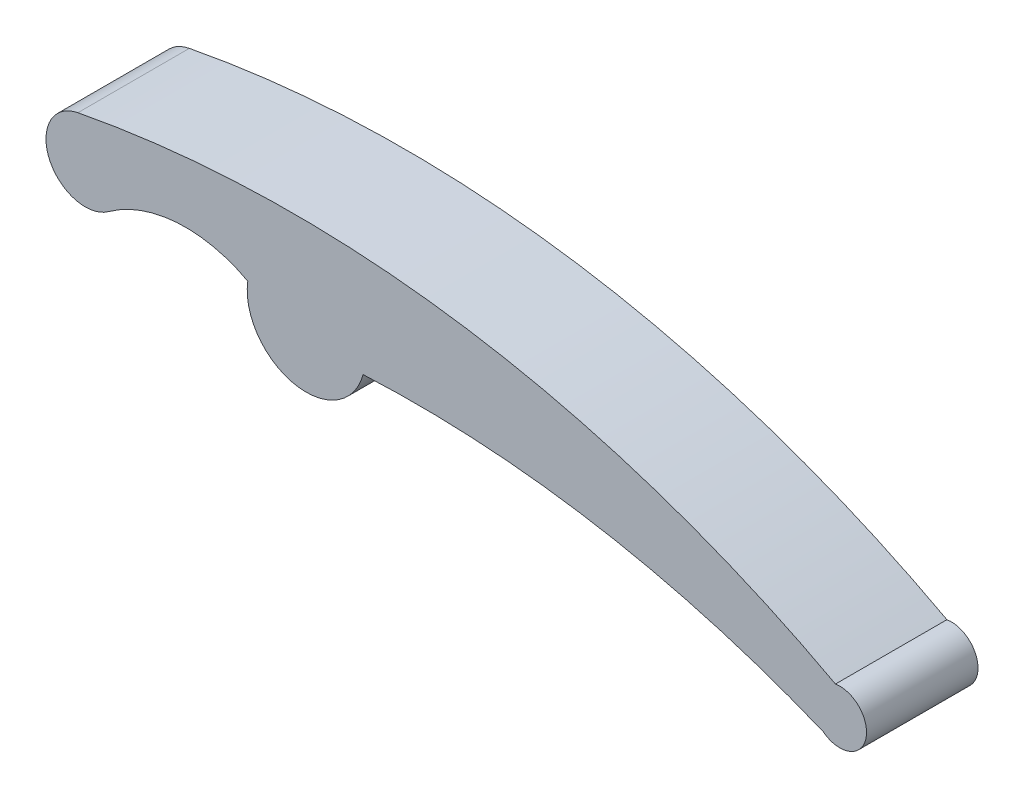
ISO-10303-21;
HEADER;
FILE_DESCRIPTION(('STEP AP214'),'2;1');
FILE_NAME('part.step','',(''),(''),'','','');
FILE_SCHEMA(('AUTOMOTIVE_DESIGN { 1 0 10303 214 1 1 1 1 }'));
ENDSEC;
DATA;
#1=APPLICATION_CONTEXT('core data for automotive mechanical design processes');
#2=APPLICATION_PROTOCOL_DEFINITION('international standard','automotive_design',2000,#1);
#3=PRODUCT_CONTEXT('',#1,'mechanical');
#4=PRODUCT('Part','Part','',(#3));
#5=PRODUCT_RELATED_PRODUCT_CATEGORY('part','',(#4));
#6=PRODUCT_DEFINITION_FORMATION('','',#4);
#7=PRODUCT_DEFINITION_CONTEXT('part definition',#1,'design');
#8=PRODUCT_DEFINITION('design','',#6,#7);
#9=PRODUCT_DEFINITION_SHAPE('','',#8);
#10=(LENGTH_UNIT() NAMED_UNIT(*) SI_UNIT(.MILLI.,.METRE.));
#11=(NAMED_UNIT(*) PLANE_ANGLE_UNIT() SI_UNIT($,.RADIAN.));
#12=(NAMED_UNIT(*) SI_UNIT($,.STERADIAN.) SOLID_ANGLE_UNIT());
#13=UNCERTAINTY_MEASURE_WITH_UNIT(LENGTH_MEASURE(1.E-05),#10,'distance_accuracy_value','');
#14=(GEOMETRIC_REPRESENTATION_CONTEXT(3) GLOBAL_UNCERTAINTY_ASSIGNED_CONTEXT((#13)) GLOBAL_UNIT_ASSIGNED_CONTEXT((#10,
#11,#12)) REPRESENTATION_CONTEXT('',''));
#15=CARTESIAN_POINT('',(0.,0.,0.));
#16=DIRECTION('',(0.,0.,1.));
#17=DIRECTION('',(1.,0.,0.));
#18=AXIS2_PLACEMENT_3D('',#15,#16,#17);
#19=CARTESIAN_POINT('',(-32.4372603048899,-28.9758539782991,30.));
#20=DIRECTION('',(0.,0.,-1.));
#21=DIRECTION('',(-1.,0.,0.));
#22=AXIS2_PLACEMENT_3D('',#19,#20,#21);
#23=CYLINDRICAL_SURFACE('',#22,35.3441616838527);
#24=CARTESIAN_POINT('',(-32.4372603048899,-28.9758539782991,0.));
#25=DIRECTION('',(0.,0.,-1.));
#26=DIRECTION('',(-1.,0.,0.));
#27=AXIS2_PLACEMENT_3D('',#24,#25,#26);
#28=CIRCLE('',#27,35.3441616838527);
#29=CARTESIAN_POINT('',(-53.2174703045222,-0.385774623643505,0.));
#30=VERTEX_POINT('',#29);
#31=CARTESIAN_POINT('',(-15.7123312658466,2.16072441068401,0.));
#32=VERTEX_POINT('',#31);
#33=EDGE_CURVE('E119',#30,#32,#28,.T.);
#34=ORIENTED_EDGE('',*,*,#33,.T.);
#35=DIRECTION('',(0.,0.,-1.));
#36=VECTOR('',#35,1.);
#37=CARTESIAN_POINT('',(-15.7123312658466,2.16072441068401,30.));
#38=LINE('',#37,#36);
#39=CARTESIAN_POINT('',(-15.7123312658466,2.16072441068401,30.));
#40=VERTEX_POINT('',#39);
#41=EDGE_CURVE('E11',#40,#32,#38,.T.);
#42=ORIENTED_EDGE('',*,*,#41,.F.);
#43=CARTESIAN_POINT('',(-32.4372603048899,-28.9758539782991,30.));
#44=DIRECTION('',(0.,0.,-1.));
#45=DIRECTION('',(-1.,0.,0.));
#46=AXIS2_PLACEMENT_3D('',#43,#44,#45);
#47=CIRCLE('',#46,35.3441616838527);
#48=CARTESIAN_POINT('',(-53.2174703045222,-0.385774623643505,30.));
#49=VERTEX_POINT('',#48);
#50=EDGE_CURVE('E129',#49,#40,#47,.T.);
#51=ORIENTED_EDGE('',*,*,#50,.F.);
#52=DIRECTION('',(0.,0.,-1.));
#53=VECTOR('',#52,1.);
#54=CARTESIAN_POINT('',(-53.2174703045222,-0.385774623643505,30.));
#55=LINE('',#54,#53);
#56=EDGE_CURVE('E115',#49,#30,#55,.T.);
#57=ORIENTED_EDGE('',*,*,#56,.T.);
#58=EDGE_LOOP('',(#34,#42,#51,#57));
#59=FACE_BOUND('',#58,.T.);
#60=ADVANCED_FACE('F35',(#59),#23,.F.);
#61=CARTESIAN_POINT('',(0.,0.,30.));
#62=DIRECTION('',(0.,0.,-1.));
#63=DIRECTION('',(-1.,0.,0.));
#64=AXIS2_PLACEMENT_3D('',#61,#62,#63);
#65=CYLINDRICAL_SURFACE('',#64,15.8602044055751);
#66=CARTESIAN_POINT('',(0.,0.,0.));
#67=DIRECTION('',(0.,0.,1.));
#68=DIRECTION('',(1.,0.,0.));
#69=AXIS2_PLACEMENT_3D('',#66,#67,#68);
#70=CIRCLE('',#69,15.8602044055751);
#71=CARTESIAN_POINT('',(15.3228748630887,-4.09335922156249,0.));
#72=VERTEX_POINT('',#71);
#73=EDGE_CURVE('E122',#32,#72,#70,.T.);
#74=ORIENTED_EDGE('',*,*,#73,.T.);
#75=DIRECTION('',(0.,0.,-1.));
#76=VECTOR('',#75,1.);
#77=CARTESIAN_POINT('',(15.3228748630887,-4.09335922156249,30.));
#78=LINE('',#77,#76);
#79=CARTESIAN_POINT('',(15.3228748630887,-4.09335922156249,30.));
#80=VERTEX_POINT('',#79);
#81=EDGE_CURVE('E43',#80,#72,#78,.T.);
#82=ORIENTED_EDGE('',*,*,#81,.F.);
#83=CARTESIAN_POINT('',(0.,0.,30.));
#84=DIRECTION('',(0.,0.,1.));
#85=DIRECTION('',(1.,0.,0.));
#86=AXIS2_PLACEMENT_3D('',#83,#84,#85);
#87=CIRCLE('',#86,15.8602044055751);
#88=EDGE_CURVE('E88',#40,#80,#87,.T.);
#89=ORIENTED_EDGE('',*,*,#88,.F.);
#90=ORIENTED_EDGE('',*,*,#41,.T.);
#91=EDGE_LOOP('',(#74,#82,#89,#90));
#92=FACE_BOUND('',#91,.T.);
#93=ADVANCED_FACE('F153',(#92),#65,.T.);
#94=CARTESIAN_POINT('',(29.5225455942049,-292.078541823757,30.));
#95=DIRECTION('',(0.,0.,-1.));
#96=DIRECTION('',(-1.,0.,0.));
#97=AXIS2_PLACEMENT_3D('',#94,#95,#96);
#98=CYLINDRICAL_SURFACE('',#97,288.33504131009);
#99=CARTESIAN_POINT('',(29.5225455942049,-292.078541823757,0.));
#100=DIRECTION('',(0.,0.,-1.));
#101=DIRECTION('',(-1.,0.,0.));
#102=AXIS2_PLACEMENT_3D('',#99,#100,#101);
#103=CIRCLE('',#102,288.33504131009);
#104=CARTESIAN_POINT('',(139.197298690067,-25.4166874451206,0.));
#105=VERTEX_POINT('',#104);
#106=EDGE_CURVE('E124',#72,#105,#103,.T.);
#107=ORIENTED_EDGE('',*,*,#106,.T.);
#108=DIRECTION('',(0.,0.,-1.));
#109=VECTOR('',#108,1.);
#110=CARTESIAN_POINT('',(139.197298690067,-25.4166874451206,30.));
#111=LINE('',#110,#109);
#112=CARTESIAN_POINT('',(139.197298690067,-25.4166874451206,30.));
#113=VERTEX_POINT('',#112);
#114=EDGE_CURVE('E110',#113,#105,#111,.T.);
#115=ORIENTED_EDGE('',*,*,#114,.F.);
#116=CARTESIAN_POINT('',(29.5225455942049,-292.078541823757,30.));
#117=DIRECTION('',(0.,0.,-1.));
#118=DIRECTION('',(-1.,0.,0.));
#119=AXIS2_PLACEMENT_3D('',#116,#117,#118);
#120=CIRCLE('',#119,288.33504131009);
#121=EDGE_CURVE('E101',#80,#113,#120,.T.);
#122=ORIENTED_EDGE('',*,*,#121,.F.);
#123=ORIENTED_EDGE('',*,*,#81,.T.);
#124=EDGE_LOOP('',(#107,#115,#122,#123));
#125=FACE_BOUND('',#124,.T.);
#126=ADVANCED_FACE('F135',(#125),#98,.F.);
#127=CARTESIAN_POINT('',(143.64751350509,-19.7583365647235,30.));
#128=DIRECTION('',(0.,0.,-1.));
#129=DIRECTION('',(-1.,0.,0.));
#130=AXIS2_PLACEMENT_3D('',#127,#128,#129);
#131=CYLINDRICAL_SURFACE('',#130,7.19870450744738);
#132=CARTESIAN_POINT('',(143.64751350509,-19.7583365647235,0.));
#133=DIRECTION('',(0.,0.,1.));
#134=DIRECTION('',(-1.,0.,0.));
#135=AXIS2_PLACEMENT_3D('',#132,#133,#134);
#136=CIRCLE('',#135,7.19870450744738);
#137=CARTESIAN_POINT('',(142.481198410258,-12.6547420038614,0.));
#138=VERTEX_POINT('',#137);
#139=EDGE_CURVE('E109',#105,#138,#136,.T.);
#140=ORIENTED_EDGE('',*,*,#139,.T.);
#141=DIRECTION('',(0.,0.,-1.));
#142=VECTOR('',#141,1.);
#143=CARTESIAN_POINT('',(142.481198410258,-12.6547420038614,30.));
#144=LINE('',#143,#142);
#145=CARTESIAN_POINT('',(142.481198410258,-12.6547420038614,30.));
#146=VERTEX_POINT('',#145);
#147=EDGE_CURVE('E106',#146,#138,#144,.T.);
#148=ORIENTED_EDGE('',*,*,#147,.F.);
#149=CARTESIAN_POINT('',(143.64751350509,-19.7583365647235,30.));
#150=DIRECTION('',(0.,0.,1.));
#151=DIRECTION('',(-1.,0.,0.));
#152=AXIS2_PLACEMENT_3D('',#149,#150,#151);
#153=CIRCLE('',#152,7.19870450744738);
#154=EDGE_CURVE('E95',#113,#146,#153,.T.);
#155=ORIENTED_EDGE('',*,*,#154,.F.);
#156=ORIENTED_EDGE('',*,*,#114,.T.);
#157=EDGE_LOOP('',(#140,#148,#155,#156));
#158=FACE_BOUND('',#157,.T.);
#159=ADVANCED_FACE('F107',(#158),#131,.T.);
#160=CARTESIAN_POINT('',(-3.38093840252931,-283.757659489302,30.));
#161=DIRECTION('',(0.,0.,-1.));
#162=DIRECTION('',(-1.,0.,0.));
#163=AXIS2_PLACEMENT_3D('',#160,#161,#162);
#164=CYLINDRICAL_SURFACE('',#163,307.851514247875);
#165=CARTESIAN_POINT('',(-3.38093840252931,-283.757659489302,0.));
#166=DIRECTION('',(0.,0.,1.));
#167=DIRECTION('',(-1.,0.,0.));
#168=AXIS2_PLACEMENT_3D('',#165,#166,#167);
#169=CIRCLE('',#168,307.851514247875);
#170=CARTESIAN_POINT('',(-61.4363507378449,18.570182303819,0.));
#171=VERTEX_POINT('',#170);
#172=EDGE_CURVE('E74',#138,#171,#169,.T.);
#173=ORIENTED_EDGE('',*,*,#172,.T.);
#174=DIRECTION('',(0.,0.,-1.));
#175=VECTOR('',#174,1.);
#176=CARTESIAN_POINT('',(-61.4363507378449,18.570182303819,30.));
#177=LINE('',#176,#175);
#178=CARTESIAN_POINT('',(-61.4363507378449,18.570182303819,30.));
#179=VERTEX_POINT('',#178);
#180=EDGE_CURVE('E111',#179,#171,#177,.T.);
#181=ORIENTED_EDGE('',*,*,#180,.F.);
#182=CARTESIAN_POINT('',(-3.38093840252931,-283.757659489302,30.));
#183=DIRECTION('',(0.,0.,1.));
#184=DIRECTION('',(-1.,0.,0.));
#185=AXIS2_PLACEMENT_3D('',#182,#183,#184);
#186=CIRCLE('',#185,307.851514247875);
#187=EDGE_CURVE('E99',#146,#179,#186,.T.);
#188=ORIENTED_EDGE('',*,*,#187,.F.);
#189=ORIENTED_EDGE('',*,*,#147,.T.);
#190=EDGE_LOOP('',(#173,#181,#188,#189));
#191=FACE_BOUND('',#190,.T.);
#192=ADVANCED_FACE('F113',(#191),#164,.T.);
#193=CARTESIAN_POINT('',(-59.4403504158993,8.17586340609371,30.));
#194=DIRECTION('',(0.,0.,-1.));
#195=DIRECTION('',(-1.,0.,0.));
#196=AXIS2_PLACEMENT_3D('',#193,#194,#195);
#197=CYLINDRICAL_SURFACE('',#196,10.5842280130775);
#198=CARTESIAN_POINT('',(-59.4403504158993,8.17586340609371,0.));
#199=DIRECTION('',(0.,0.,1.));
#200=DIRECTION('',(1.,0.,0.));
#201=AXIS2_PLACEMENT_3D('',#198,#199,#200);
#202=CIRCLE('',#201,10.5842280130775);
#203=EDGE_CURVE('E80',#171,#30,#202,.T.);
#204=ORIENTED_EDGE('',*,*,#203,.T.);
#205=ORIENTED_EDGE('',*,*,#56,.F.);
#206=CARTESIAN_POINT('',(-59.4403504158993,8.17586340609371,30.));
#207=DIRECTION('',(0.,0.,1.));
#208=DIRECTION('',(1.,0.,0.));
#209=AXIS2_PLACEMENT_3D('',#206,#207,#208);
#210=CIRCLE('',#209,10.5842280130775);
#211=EDGE_CURVE('E51',#179,#49,#210,.T.);
#212=ORIENTED_EDGE('',*,*,#211,.F.);
#213=ORIENTED_EDGE('',*,*,#180,.T.);
#214=EDGE_LOOP('',(#204,#205,#212,#213));
#215=FACE_BOUND('',#214,.T.);
#216=ADVANCED_FACE('F142',(#215),#197,.T.);
#217=CARTESIAN_POINT('',(-16.2186301524449,-14.4879269891495,30.));
#218=DIRECTION('',(0.,0.,-1.));
#219=DIRECTION('',(-1.,0.,0.));
#220=AXIS2_PLACEMENT_3D('',#217,#218,#219);
#221=PLANE('',#220);
#222=ORIENTED_EDGE('',*,*,#50,.T.);
#223=ORIENTED_EDGE('',*,*,#88,.T.);
#224=ORIENTED_EDGE('',*,*,#121,.T.);
#225=ORIENTED_EDGE('',*,*,#154,.T.);
#226=ORIENTED_EDGE('',*,*,#187,.T.);
#227=ORIENTED_EDGE('',*,*,#211,.T.);
#228=EDGE_LOOP('',(#222,#223,#224,#225,#226,#227));
#229=FACE_BOUND('',#228,.T.);
#230=ADVANCED_FACE('F97',(#229),#221,.F.);
#231=CARTESIAN_POINT('',(-16.2186301524449,-14.4879269891495,0.));
#232=DIRECTION('',(0.,0.,-1.));
#233=DIRECTION('',(-1.,0.,0.));
#234=AXIS2_PLACEMENT_3D('',#231,#232,#233);
#235=PLANE('',#234);
#236=ORIENTED_EDGE('',*,*,#33,.F.);
#237=ORIENTED_EDGE('',*,*,#203,.F.);
#238=ORIENTED_EDGE('',*,*,#172,.F.);
#239=ORIENTED_EDGE('',*,*,#139,.F.);
#240=ORIENTED_EDGE('',*,*,#106,.F.);
#241=ORIENTED_EDGE('',*,*,#73,.F.);
#242=EDGE_LOOP('',(#236,#237,#238,#239,#240,#241));
#243=FACE_BOUND('',#242,.T.);
#244=ADVANCED_FACE('F138',(#243),#235,.T.);
#245=CLOSED_SHELL('',(#60,#93,#126,#159,#192,#216,#230,#244));
#246=MANIFOLD_SOLID_BREP('B2',#245);
#247=ADVANCED_BREP_SHAPE_REPRESENTATION('',(#18,#246),#14);
#248=SHAPE_DEFINITION_REPRESENTATION(#9,#247);
ENDSEC;
END-ISO-10303-21;
